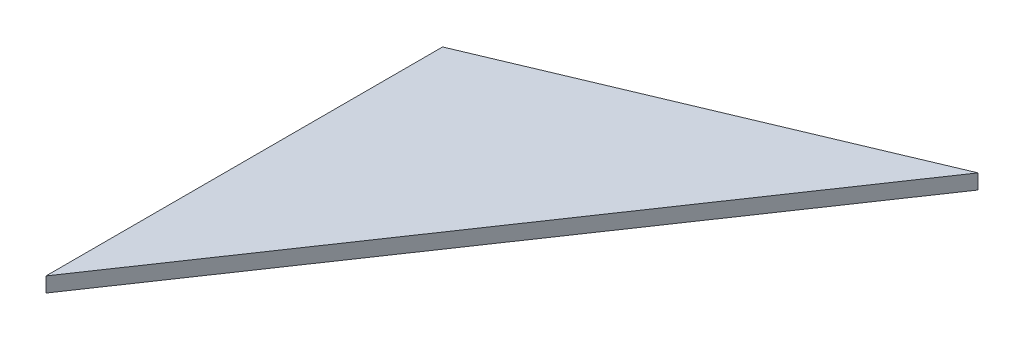
ISO-10303-21;
HEADER;
FILE_DESCRIPTION(('STEP AP214'),'2;1');
FILE_NAME('part.step','',(''),(''),'','','');
FILE_SCHEMA(('AUTOMOTIVE_DESIGN { 1 0 10303 214 1 1 1 1 }'));
ENDSEC;
DATA;
#1=APPLICATION_CONTEXT('core data for automotive mechanical design processes');
#2=APPLICATION_PROTOCOL_DEFINITION('international standard','automotive_design',2000,#1);
#3=PRODUCT_CONTEXT('',#1,'mechanical');
#4=PRODUCT('Part','Part','',(#3));
#5=PRODUCT_RELATED_PRODUCT_CATEGORY('part','',(#4));
#6=PRODUCT_DEFINITION_FORMATION('','',#4);
#7=PRODUCT_DEFINITION_CONTEXT('part definition',#1,'design');
#8=PRODUCT_DEFINITION('design','',#6,#7);
#9=PRODUCT_DEFINITION_SHAPE('','',#8);
#10=(LENGTH_UNIT() NAMED_UNIT(*) SI_UNIT(.MILLI.,.METRE.));
#11=(NAMED_UNIT(*) PLANE_ANGLE_UNIT() SI_UNIT($,.RADIAN.));
#12=(NAMED_UNIT(*) SI_UNIT($,.STERADIAN.) SOLID_ANGLE_UNIT());
#13=UNCERTAINTY_MEASURE_WITH_UNIT(LENGTH_MEASURE(1.E-05),#10,'distance_accuracy_value','');
#14=(GEOMETRIC_REPRESENTATION_CONTEXT(3) GLOBAL_UNCERTAINTY_ASSIGNED_CONTEXT((#13)) GLOBAL_UNIT_ASSIGNED_CONTEXT((#10,
#11,#12)) REPRESENTATION_CONTEXT('',''));
#15=CARTESIAN_POINT('',(0.,0.,0.));
#16=DIRECTION('',(0.,0.,1.));
#17=DIRECTION('',(1.,0.,0.));
#18=AXIS2_PLACEMENT_3D('',#15,#16,#17);
#19=CARTESIAN_POINT('',(120.65,4.7625,-177.8));
#20=DIRECTION('',(-0.827475774391758,0.,-0.561501418337265));
#21=DIRECTION('',(-0.561501418337265,0.,0.827475774391758));
#22=AXIS2_PLACEMENT_3D('',#19,#20,#21);
#23=PLANE('',#22);
#24=DIRECTION('',(0.561501418337265,0.,-0.827475774391758));
#25=VECTOR('',#24,1.);
#26=CARTESIAN_POINT('',(120.65,0.,-177.8));
#27=LINE('',#26,#25);
#28=CARTESIAN_POINT('',(0.,0.,0.));
#29=VERTEX_POINT('',#28);
#30=CARTESIAN_POINT('',(120.65,0.,-177.8));
#31=VERTEX_POINT('',#30);
#32=EDGE_CURVE('E80',#29,#31,#27,.T.);
#33=ORIENTED_EDGE('',*,*,#32,.T.);
#34=DIRECTION('',(0.,-1.,0.));
#35=VECTOR('',#34,1.);
#36=CARTESIAN_POINT('',(120.65,4.7625,-177.8));
#37=LINE('',#36,#35);
#38=CARTESIAN_POINT('',(120.65,4.7625,-177.8));
#39=VERTEX_POINT('',#38);
#40=EDGE_CURVE('E11',#39,#31,#37,.T.);
#41=ORIENTED_EDGE('',*,*,#40,.F.);
#42=DIRECTION('',(0.561501418337265,0.,-0.827475774391758));
#43=VECTOR('',#42,1.);
#44=CARTESIAN_POINT('',(120.65,4.7625,-177.8));
#45=LINE('',#44,#43);
#46=CARTESIAN_POINT('',(0.,4.7625,0.));
#47=VERTEX_POINT('',#46);
#48=EDGE_CURVE('E73',#47,#39,#45,.T.);
#49=ORIENTED_EDGE('',*,*,#48,.F.);
#50=DIRECTION('',(0.,-1.,0.));
#51=VECTOR('',#50,1.);
#52=CARTESIAN_POINT('',(0.,4.7625,0.));
#53=LINE('',#52,#51);
#54=EDGE_CURVE('E81',#47,#29,#53,.T.);
#55=ORIENTED_EDGE('',*,*,#54,.T.);
#56=EDGE_LOOP('',(#33,#41,#49,#55));
#57=FACE_BOUND('',#56,.T.);
#58=ADVANCED_FACE('F33',(#57),#23,.F.);
#59=CARTESIAN_POINT('',(0.,4.7625,-127.));
#60=DIRECTION('',(0.388057000058133,0.,0.921635375138065));
#61=DIRECTION('',(0.921635375138065,0.,-0.388057000058133));
#62=AXIS2_PLACEMENT_3D('',#59,#60,#61);
#63=PLANE('',#62);
#64=DIRECTION('',(-0.921635375138065,0.,0.388057000058133));
#65=VECTOR('',#64,1.);
#66=CARTESIAN_POINT('',(0.,0.,-127.));
#67=LINE('',#66,#65);
#68=CARTESIAN_POINT('',(0.,0.,-127.));
#69=VERTEX_POINT('',#68);
#70=EDGE_CURVE('E61',#31,#69,#67,.T.);
#71=ORIENTED_EDGE('',*,*,#70,.T.);
#72=DIRECTION('',(0.,-1.,0.));
#73=VECTOR('',#72,1.);
#74=CARTESIAN_POINT('',(0.,4.7625,-127.));
#75=LINE('',#74,#73);
#76=CARTESIAN_POINT('',(0.,4.7625,-127.));
#77=VERTEX_POINT('',#76);
#78=EDGE_CURVE('E41',#77,#69,#75,.T.);
#79=ORIENTED_EDGE('',*,*,#78,.F.);
#80=DIRECTION('',(-0.921635375138065,0.,0.388057000058133));
#81=VECTOR('',#80,1.);
#82=CARTESIAN_POINT('',(0.,4.7625,-127.));
#83=LINE('',#82,#81);
#84=EDGE_CURVE('E69',#39,#77,#83,.T.);
#85=ORIENTED_EDGE('',*,*,#84,.F.);
#86=ORIENTED_EDGE('',*,*,#40,.T.);
#87=EDGE_LOOP('',(#71,#79,#85,#86));
#88=FACE_BOUND('',#87,.T.);
#89=ADVANCED_FACE('F70',(#88),#63,.F.);
#90=CARTESIAN_POINT('',(0.,4.7625,0.));
#91=DIRECTION('',(1.,0.,0.));
#92=DIRECTION('',(0.,0.,-1.));
#93=AXIS2_PLACEMENT_3D('',#90,#91,#92);
#94=PLANE('',#93);
#95=DIRECTION('',(0.,0.,1.));
#96=VECTOR('',#95,1.);
#97=CARTESIAN_POINT('',(0.,0.,0.));
#98=LINE('',#97,#96);
#99=EDGE_CURVE('E66',#69,#29,#98,.T.);
#100=ORIENTED_EDGE('',*,*,#99,.T.);
#101=ORIENTED_EDGE('',*,*,#54,.F.);
#102=DIRECTION('',(0.,0.,1.));
#103=VECTOR('',#102,1.);
#104=CARTESIAN_POINT('',(0.,4.7625,0.));
#105=LINE('',#104,#103);
#106=EDGE_CURVE('E49',#77,#47,#105,.T.);
#107=ORIENTED_EDGE('',*,*,#106,.F.);
#108=ORIENTED_EDGE('',*,*,#78,.T.);
#109=EDGE_LOOP('',(#100,#101,#107,#108));
#110=FACE_BOUND('',#109,.T.);
#111=ADVANCED_FACE('F88',(#110),#94,.F.);
#112=CARTESIAN_POINT('',(0.,4.7625,0.));
#113=DIRECTION('',(0.,-1.,0.));
#114=DIRECTION('',(0.,0.,-1.));
#115=AXIS2_PLACEMENT_3D('',#112,#113,#114);
#116=PLANE('',#115);
#117=ORIENTED_EDGE('',*,*,#48,.T.);
#118=ORIENTED_EDGE('',*,*,#84,.T.);
#119=ORIENTED_EDGE('',*,*,#106,.T.);
#120=EDGE_LOOP('',(#117,#118,#119));
#121=FACE_BOUND('',#120,.T.);
#122=ADVANCED_FACE('F76',(#121),#116,.F.);
#123=CARTESIAN_POINT('',(0.,0.,0.));
#124=DIRECTION('',(0.,-1.,0.));
#125=DIRECTION('',(0.,0.,-1.));
#126=AXIS2_PLACEMENT_3D('',#123,#124,#125);
#127=PLANE('',#126);
#128=ORIENTED_EDGE('',*,*,#32,.F.);
#129=ORIENTED_EDGE('',*,*,#99,.F.);
#130=ORIENTED_EDGE('',*,*,#70,.F.);
#131=EDGE_LOOP('',(#128,#129,#130));
#132=FACE_BOUND('',#131,.T.);
#133=ADVANCED_FACE('F89',(#132),#127,.T.);
#134=CLOSED_SHELL('',(#58,#89,#111,#122,#133));
#135=MANIFOLD_SOLID_BREP('B2',#134);
#136=ADVANCED_BREP_SHAPE_REPRESENTATION('',(#18,#135),#14);
#137=SHAPE_DEFINITION_REPRESENTATION(#9,#136);
ENDSEC;
END-ISO-10303-21;
